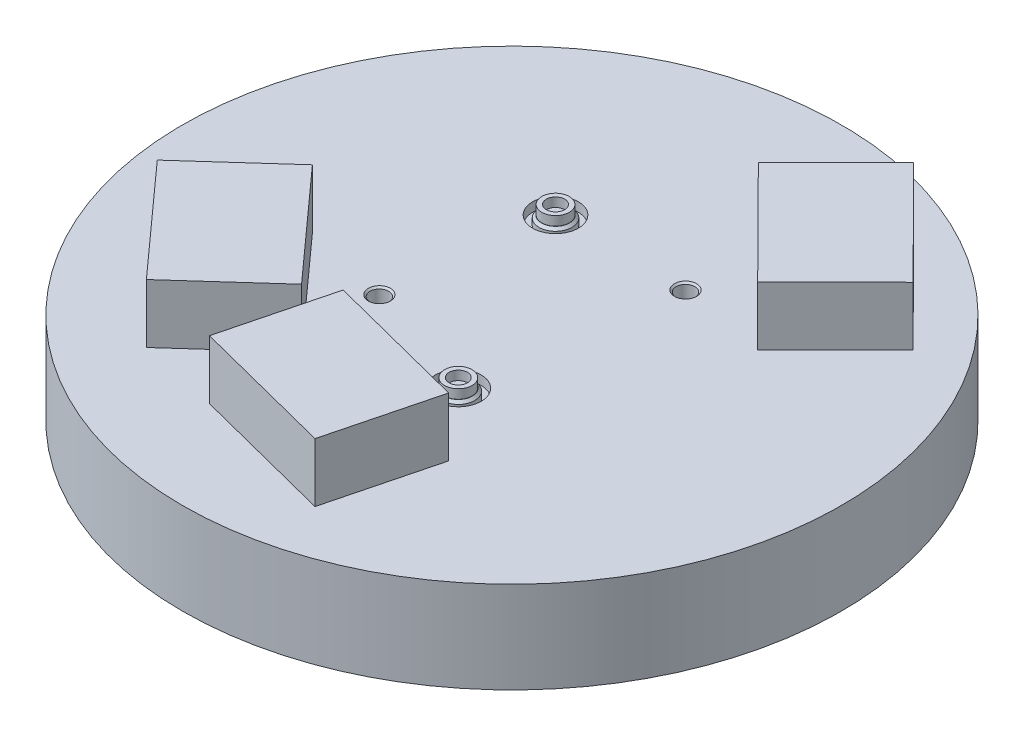
ISO-10303-21;
HEADER;
FILE_DESCRIPTION(('STEP AP214'),'2;1');
FILE_NAME('part.step','',(''),(''),'','','');
FILE_SCHEMA(('AUTOMOTIVE_DESIGN { 1 0 10303 214 1 1 1 1 }'));
ENDSEC;
DATA;
#1=APPLICATION_CONTEXT('core data for automotive mechanical design processes');
#2=APPLICATION_PROTOCOL_DEFINITION('international standard','automotive_design',2000,#1);
#3=PRODUCT_CONTEXT('',#1,'mechanical');
#4=PRODUCT('Part','Part','',(#3));
#5=PRODUCT_RELATED_PRODUCT_CATEGORY('part','',(#4));
#6=PRODUCT_DEFINITION_FORMATION('','',#4);
#7=PRODUCT_DEFINITION_CONTEXT('part definition',#1,'design');
#8=PRODUCT_DEFINITION('design','',#6,#7);
#9=PRODUCT_DEFINITION_SHAPE('','',#8);
#10=(LENGTH_UNIT() NAMED_UNIT(*) SI_UNIT(.MILLI.,.METRE.));
#11=(NAMED_UNIT(*) PLANE_ANGLE_UNIT() SI_UNIT($,.RADIAN.));
#12=(NAMED_UNIT(*) SI_UNIT($,.STERADIAN.) SOLID_ANGLE_UNIT());
#13=UNCERTAINTY_MEASURE_WITH_UNIT(LENGTH_MEASURE(1.E-05),#10,'distance_accuracy_value','');
#14=(GEOMETRIC_REPRESENTATION_CONTEXT(3) GLOBAL_UNCERTAINTY_ASSIGNED_CONTEXT((#13)) GLOBAL_UNIT_ASSIGNED_CONTEXT((#10,
#11,#12)) REPRESENTATION_CONTEXT('',''));
#15=CARTESIAN_POINT('',(0.,0.,0.));
#16=DIRECTION('',(0.,0.,1.));
#17=DIRECTION('',(1.,0.,0.));
#18=AXIS2_PLACEMENT_3D('',#15,#16,#17);
#19=CARTESIAN_POINT('',(0.,50.,0.));
#20=DIRECTION('',(0.,1.,0.));
#21=DIRECTION('',(0.,0.,1.));
#22=AXIS2_PLACEMENT_3D('',#19,#20,#21);
#23=PLANE('',#22);
#24=CARTESIAN_POINT('',(35.5000000000001,50.,-59.3));
#25=DIRECTION('',(0.,1.,0.));
#26=DIRECTION('',(0.,0.,1.));
#27=AXIS2_PLACEMENT_3D('',#24,#25,#26);
#28=CIRCLE('',#27,6.025);
#29=CARTESIAN_POINT('',(35.5000000000001,50.,-53.275));
#30=VERTEX_POINT('',#29);
#31=EDGE_CURVE('E154',#30,#30,#28,.T.);
#32=ORIENTED_EDGE('',*,*,#31,.F.);
#33=EDGE_LOOP('',(#32));
#34=FACE_BOUND('',#33,.T.);
#35=CARTESIAN_POINT('',(-45.899,50.,26.5000000000001));
#36=DIRECTION('',(0.,1.,0.));
#37=DIRECTION('',(0.,0.,1.));
#38=AXIS2_PLACEMENT_3D('',#35,#36,#37);
#39=CIRCLE('',#38,6.025);
#40=CARTESIAN_POINT('',(-45.899,50.,32.5250000000001));
#41=VERTEX_POINT('',#40);
#42=EDGE_CURVE('E147',#41,#41,#39,.T.);
#43=ORIENTED_EDGE('',*,*,#42,.F.);
#44=EDGE_LOOP('',(#43));
#45=FACE_BOUND('',#44,.T.);
#46=CARTESIAN_POINT('',(-35.4999999999999,50.,-59.3));
#47=DIRECTION('',(0.,1.,0.));
#48=DIRECTION('',(0.,0.,1.));
#49=AXIS2_PLACEMENT_3D('',#46,#47,#48);
#50=CIRCLE('',#49,12.5);
#51=CARTESIAN_POINT('',(-35.4999999999999,50.,-46.8));
#52=VERTEX_POINT('',#51);
#53=EDGE_CURVE('E168',#52,#52,#50,.T.);
#54=ORIENTED_EDGE('',*,*,#53,.F.);
#55=EDGE_LOOP('',(#54));
#56=FACE_BOUND('',#55,.T.);
#57=CARTESIAN_POINT('',(19.8540000000001,50.,49.141));
#58=DIRECTION('',(0.,1.,0.));
#59=DIRECTION('',(0.,0.,1.));
#60=AXIS2_PLACEMENT_3D('',#57,#58,#59);
#61=CIRCLE('',#60,12.5);
#62=CARTESIAN_POINT('',(19.8540000000001,50.,61.641));
#63=VERTEX_POINT('',#62);
#64=EDGE_CURVE('E163',#63,#63,#61,.T.);
#65=ORIENTED_EDGE('',*,*,#64,.F.);
#66=EDGE_LOOP('',(#65));
#67=FACE_BOUND('',#66,.T.);
#68=CARTESIAN_POINT('',(0.,50.,0.));
#69=DIRECTION('',(0.,1.,0.));
#70=DIRECTION('',(0.,0.,1.));
#71=AXIS2_PLACEMENT_3D('',#68,#69,#70);
#72=CIRCLE('',#71,180.);
#73=CARTESIAN_POINT('',(0.,50.,180.));
#74=VERTEX_POINT('',#73);
#75=EDGE_CURVE('E268',#74,#74,#72,.T.);
#76=ORIENTED_EDGE('',*,*,#75,.T.);
#77=EDGE_LOOP('',(#76));
#78=FACE_BOUND('',#77,.T.);
#79=DIRECTION('',(0.668982252871279,0.,0.74327837674943));
#80=VECTOR('',#79,1.);
#81=CARTESIAN_POINT('',(-138.066787268597,50.,55.6393031829152));
#82=LINE('',#81,#80);
#83=CARTESIAN_POINT('',(-138.066787268597,50.,55.6393031829151));
#84=VERTEX_POINT('',#83);
#85=CARTESIAN_POINT('',(-84.548207038895,50.,115.10157332287));
#86=VERTEX_POINT('',#85);
#87=EDGE_CURVE('E216',#84,#86,#82,.T.);
#88=ORIENTED_EDGE('',*,*,#87,.F.);
#89=DIRECTION('',(-0.74327837674943,0.,0.668982252871279));
#90=VECTOR('',#89,1.);
#91=CARTESIAN_POINT('',(-93.4700846636315,50.,15.5003680106384));
#92=LINE('',#91,#90);
#93=CARTESIAN_POINT('',(-93.4700846636315,50.,15.5003680106384));
#94=VERTEX_POINT('',#93);
#95=EDGE_CURVE('E255',#94,#84,#92,.T.);
#96=ORIENTED_EDGE('',*,*,#95,.F.);
#97=DIRECTION('',(-0.668982252871279,0.,-0.74327837674943));
#98=VECTOR('',#97,1.);
#99=CARTESIAN_POINT('',(-39.9515044339292,50.,74.9626381505928));
#100=LINE('',#99,#98);
#101=CARTESIAN_POINT('',(-39.9515044339292,50.,74.9626381505928));
#102=VERTEX_POINT('',#101);
#103=EDGE_CURVE('E252',#102,#94,#100,.T.);
#104=ORIENTED_EDGE('',*,*,#103,.F.);
#105=DIRECTION('',(0.74327837674943,0.,-0.668982252871279));
#106=VECTOR('',#105,1.);
#107=CARTESIAN_POINT('',(-84.548207038895,50.,115.10157332287));
#108=LINE('',#107,#106);
#109=EDGE_CURVE('E249',#86,#102,#108,.T.);
#110=ORIENTED_EDGE('',*,*,#109,.F.);
#111=EDGE_LOOP('',(#88,#96,#104,#110));
#112=FACE_BOUND('',#111,.T.);
#113=DIRECTION('',(-0.248310349340247,0.,0.968680530624274));
#114=VECTOR('',#113,1.);
#115=CARTESIAN_POINT('',(-25.8459110064985,50.,66.3316408838687));
#116=LINE('',#115,#114);
#117=CARTESIAN_POINT('',(-25.8459110064985,50.,66.3316408838686));
#118=VERTEX_POINT('',#117);
#119=CARTESIAN_POINT('',(-40.7445319669134,50.,124.452472721325));
#120=VERTEX_POINT('',#119);
#121=EDGE_CURVE('E186',#118,#120,#116,.T.);
#122=ORIENTED_EDGE('',*,*,#121,.F.);
#123=DIRECTION('',(-0.968680530624274,0.,-0.248310349340247));
#124=VECTOR('',#123,1.);
#125=CARTESIAN_POINT('',(51.6485314434434,50.,86.1964688310884));
#126=LINE('',#125,#124);
#127=CARTESIAN_POINT('',(51.6485314434434,50.,86.1964688310884));
#128=VERTEX_POINT('',#127);
#129=EDGE_CURVE('E65',#128,#118,#126,.T.);
#130=ORIENTED_EDGE('',*,*,#129,.F.);
#131=DIRECTION('',(0.248310349340247,0.,-0.968680530624274));
#132=VECTOR('',#131,1.);
#133=CARTESIAN_POINT('',(36.7499104830285,50.,144.317300668545));
#134=LINE('',#133,#132);
#135=CARTESIAN_POINT('',(36.7499104830285,50.,144.317300668545));
#136=VERTEX_POINT('',#135);
#137=EDGE_CURVE('E222',#136,#128,#134,.T.);
#138=ORIENTED_EDGE('',*,*,#137,.F.);
#139=DIRECTION('',(0.968680530624274,0.,0.248310349340247));
#140=VECTOR('',#139,1.);
#141=CARTESIAN_POINT('',(-40.7445319669134,50.,124.452472721325));
#142=LINE('',#141,#140);
#143=EDGE_CURVE('E219',#120,#136,#142,.T.);
#144=ORIENTED_EDGE('',*,*,#143,.F.);
#145=EDGE_LOOP('',(#122,#130,#138,#144));
#146=FACE_BOUND('',#145,.T.);
#147=DIRECTION('',(0.70929710886614,0.,-0.704909647652899));
#148=VECTOR('',#147,1.);
#149=CARTESIAN_POINT('',(83.556704954368,50.,-50.665585779636));
#150=LINE('',#149,#148);
#151=CARTESIAN_POINT('',(83.556704954368,50.,-50.665585779636));
#152=VERTEX_POINT('',#151);
#153=CARTESIAN_POINT('',(126.114531486336,50.,-92.9601646388099));
#154=VERTEX_POINT('',#153);
#155=EDGE_CURVE('E167',#152,#154,#150,.T.);
#156=ORIENTED_EDGE('',*,*,#155,.F.);
#157=DIRECTION('',(0.704909647652899,0.,0.70929710886614));
#158=VECTOR('',#157,1.);
#159=CARTESIAN_POINT('',(27.163933142136,50.,-107.409354488927));
#160=LINE('',#159,#158);
#161=CARTESIAN_POINT('',(27.163933142136,50.,-107.409354488927));
#162=VERTEX_POINT('',#161);
#163=EDGE_CURVE('E57',#162,#152,#160,.T.);
#164=ORIENTED_EDGE('',*,*,#163,.F.);
#165=DIRECTION('',(-0.70929710886614,0.,0.7049096476529));
#166=VECTOR('',#165,1.);
#167=CARTESIAN_POINT('',(69.7217596741044,50.,-149.703933348101));
#168=LINE('',#167,#166);
#169=CARTESIAN_POINT('',(69.7217596741044,50.,-149.703933348101));
#170=VERTEX_POINT('',#169);
#171=EDGE_CURVE('E192',#170,#162,#168,.T.);
#172=ORIENTED_EDGE('',*,*,#171,.F.);
#173=DIRECTION('',(-0.704909647652899,0.,-0.70929710886614));
#174=VECTOR('',#173,1.);
#175=CARTESIAN_POINT('',(126.114531486336,50.,-92.9601646388099));
#176=LINE('',#175,#174);
#177=EDGE_CURVE('E189',#154,#170,#176,.T.);
#178=ORIENTED_EDGE('',*,*,#177,.F.);
#179=EDGE_LOOP('',(#156,#164,#172,#178));
#180=FACE_BOUND('',#179,.T.);
#181=ADVANCED_FACE('F42',(#34,#45,#56,#67,#78,#112,#146,#180),#23,.T.);
#182=CARTESIAN_POINT('',(0.,50.,0.));
#183=DIRECTION('',(0.,-1.,0.));
#184=DIRECTION('',(0.,0.,-1.));
#185=AXIS2_PLACEMENT_3D('',#182,#183,#184);
#186=CYLINDRICAL_SURFACE('',#185,180.);
#187=ORIENTED_EDGE('',*,*,#75,.F.);
#188=EDGE_LOOP('',(#187));
#189=FACE_BOUND('',#188,.T.);
#190=CARTESIAN_POINT('',(0.,0.,0.));
#191=DIRECTION('',(0.,1.,0.));
#192=DIRECTION('',(0.,0.,1.));
#193=AXIS2_PLACEMENT_3D('',#190,#191,#192);
#194=CIRCLE('',#193,180.);
#195=CARTESIAN_POINT('',(0.,0.,180.));
#196=VERTEX_POINT('',#195);
#197=EDGE_CURVE('E246',#196,#196,#194,.T.);
#198=ORIENTED_EDGE('',*,*,#197,.T.);
#199=EDGE_LOOP('',(#198));
#200=FACE_BOUND('',#199,.T.);
#201=ADVANCED_FACE('F44',(#189,#200),#186,.T.);
#202=CARTESIAN_POINT('',(0.,0.,0.));
#203=DIRECTION('',(0.,1.,0.));
#204=DIRECTION('',(0.,0.,1.));
#205=AXIS2_PLACEMENT_3D('',#202,#203,#204);
#206=PLANE('',#205);
#207=ORIENTED_EDGE('',*,*,#197,.F.);
#208=EDGE_LOOP('',(#207));
#209=FACE_BOUND('',#208,.T.);
#210=ADVANCED_FACE('F304',(#209),#206,.F.);
#211=CARTESIAN_POINT('',(-93.4700846636316,222.147882159883,15.5003680106383));
#212=DIRECTION('',(0.668982252871279,0.,0.74327837674943));
#213=DIRECTION('',(0.74327837674943,0.,-0.668982252871279));
#214=AXIS2_PLACEMENT_3D('',#211,#212,#213);
#215=PLANE('',#214);
#216=DIRECTION('',(0.,-1.,0.));
#217=VECTOR('',#216,1.);
#218=CARTESIAN_POINT('',(-138.066787268597,222.147882159883,55.6393031829151));
#219=LINE('',#218,#217);
#220=CARTESIAN_POINT('',(-138.066787268597,82.1485421551265,55.6393031829152));
#221=VERTEX_POINT('',#220);
#222=EDGE_CURVE('E257',#221,#84,#219,.T.);
#223=ORIENTED_EDGE('',*,*,#222,.F.);
#224=DIRECTION('',(0.74327837674943,0.,-0.668982252871279));
#225=VECTOR('',#224,1.);
#226=CARTESIAN_POINT('',(-93.4700846636315,82.1485421551265,15.5003680106384));
#227=LINE('',#226,#225);
#228=CARTESIAN_POINT('',(-93.4700846636315,82.1485421551265,15.5003680106384));
#229=VERTEX_POINT('',#228);
#230=EDGE_CURVE('E240',#221,#229,#227,.T.);
#231=ORIENTED_EDGE('',*,*,#230,.T.);
#232=DIRECTION('',(0.,-1.,0.));
#233=VECTOR('',#232,1.);
#234=CARTESIAN_POINT('',(-93.4700846636316,222.147882159883,15.5003680106383));
#235=LINE('',#234,#233);
#236=EDGE_CURVE('E260',#229,#94,#235,.T.);
#237=ORIENTED_EDGE('',*,*,#236,.T.);
#238=ORIENTED_EDGE('',*,*,#95,.T.);
#239=EDGE_LOOP('',(#223,#231,#237,#238));
#240=FACE_BOUND('',#239,.T.);
#241=ADVANCED_FACE('F312',(#240),#215,.F.);
#242=CARTESIAN_POINT('',(-39.9515044339293,222.147882159883,74.9626381505927));
#243=DIRECTION('',(-0.74327837674943,0.,0.668982252871279));
#244=DIRECTION('',(0.668982252871279,0.,0.74327837674943));
#245=AXIS2_PLACEMENT_3D('',#242,#243,#244);
#246=PLANE('',#245);
#247=ORIENTED_EDGE('',*,*,#236,.F.);
#248=DIRECTION('',(0.668982252871279,0.,0.74327837674943));
#249=VECTOR('',#248,1.);
#250=CARTESIAN_POINT('',(-39.9515044339292,82.1485421551265,74.9626381505928));
#251=LINE('',#250,#249);
#252=CARTESIAN_POINT('',(-39.9515044339292,82.1485421551265,74.9626381505928));
#253=VERTEX_POINT('',#252);
#254=EDGE_CURVE('E236',#229,#253,#251,.T.);
#255=ORIENTED_EDGE('',*,*,#254,.T.);
#256=DIRECTION('',(0.,-1.,0.));
#257=VECTOR('',#256,1.);
#258=CARTESIAN_POINT('',(-39.9515044339293,222.147882159883,74.9626381505927));
#259=LINE('',#258,#257);
#260=EDGE_CURVE('E262',#253,#102,#259,.T.);
#261=ORIENTED_EDGE('',*,*,#260,.T.);
#262=ORIENTED_EDGE('',*,*,#103,.T.);
#263=EDGE_LOOP('',(#247,#255,#261,#262));
#264=FACE_BOUND('',#263,.T.);
#265=ADVANCED_FACE('F317',(#264),#246,.F.);
#266=CARTESIAN_POINT('',(-84.5482070388951,222.147882159883,115.10157332287));
#267=DIRECTION('',(-0.668982252871279,0.,-0.74327837674943));
#268=DIRECTION('',(-0.74327837674943,0.,0.668982252871279));
#269=AXIS2_PLACEMENT_3D('',#266,#267,#268);
#270=PLANE('',#269);
#271=ORIENTED_EDGE('',*,*,#260,.F.);
#272=DIRECTION('',(-0.74327837674943,0.,0.668982252871279));
#273=VECTOR('',#272,1.);
#274=CARTESIAN_POINT('',(-84.548207038895,82.1485421551265,115.10157332287));
#275=LINE('',#274,#273);
#276=CARTESIAN_POINT('',(-84.5482070388951,82.1485421551265,115.10157332287));
#277=VERTEX_POINT('',#276);
#278=EDGE_CURVE('E239',#253,#277,#275,.T.);
#279=ORIENTED_EDGE('',*,*,#278,.T.);
#280=DIRECTION('',(0.,-1.,0.));
#281=VECTOR('',#280,1.);
#282=CARTESIAN_POINT('',(-84.5482070388951,222.147882159883,115.10157332287));
#283=LINE('',#282,#281);
#284=EDGE_CURVE('E264',#277,#86,#283,.T.);
#285=ORIENTED_EDGE('',*,*,#284,.T.);
#286=ORIENTED_EDGE('',*,*,#109,.T.);
#287=EDGE_LOOP('',(#271,#279,#285,#286));
#288=FACE_BOUND('',#287,.T.);
#289=ADVANCED_FACE('F325',(#288),#270,.F.);
#290=CARTESIAN_POINT('',(-138.066787268597,222.147882159883,55.6393031829151));
#291=DIRECTION('',(0.74327837674943,0.,-0.668982252871279));
#292=DIRECTION('',(-0.668982252871279,0.,-0.74327837674943));
#293=AXIS2_PLACEMENT_3D('',#290,#291,#292);
#294=PLANE('',#293);
#295=ORIENTED_EDGE('',*,*,#284,.F.);
#296=DIRECTION('',(-0.668982252871279,0.,-0.74327837674943));
#297=VECTOR('',#296,1.);
#298=CARTESIAN_POINT('',(-138.066787268597,82.1485421551265,55.6393031829151));
#299=LINE('',#298,#297);
#300=EDGE_CURVE('E243',#277,#221,#299,.T.);
#301=ORIENTED_EDGE('',*,*,#300,.T.);
#302=ORIENTED_EDGE('',*,*,#222,.T.);
#303=ORIENTED_EDGE('',*,*,#87,.T.);
#304=EDGE_LOOP('',(#295,#301,#302,#303));
#305=FACE_BOUND('',#304,.T.);
#306=ADVANCED_FACE('F309',(#305),#294,.F.);
#307=CARTESIAN_POINT('',(69.7217610432258,82.1485421551264,-149.70393282983));
#308=DIRECTION('',(0.,-1.,0.));
#309=DIRECTION('',(0.709297119541637,0.,-0.704909636910957));
#310=AXIS2_PLACEMENT_3D('',#307,#308,#309);
#311=PLANE('',#310);
#312=ORIENTED_EDGE('',*,*,#278,.F.);
#313=ORIENTED_EDGE('',*,*,#254,.F.);
#314=ORIENTED_EDGE('',*,*,#230,.F.);
#315=ORIENTED_EDGE('',*,*,#300,.F.);
#316=EDGE_LOOP('',(#312,#313,#314,#315));
#317=FACE_BOUND('',#316,.T.);
#318=ADVANCED_FACE('F330',(#317),#311,.F.);
#319=CARTESIAN_POINT('',(51.6485314434433,222.147882159883,86.1964688310883));
#320=DIRECTION('',(-0.248310349340247,0.,0.968680530624274));
#321=DIRECTION('',(0.968680530624274,0.,0.248310349340247));
#322=AXIS2_PLACEMENT_3D('',#319,#320,#321);
#323=PLANE('',#322);
#324=DIRECTION('',(0.,-1.,0.));
#325=VECTOR('',#324,1.);
#326=CARTESIAN_POINT('',(-25.8459110064986,222.147882159883,66.3316408838686));
#327=LINE('',#326,#325);
#328=CARTESIAN_POINT('',(-25.8459110064986,82.1485421551265,66.3316408838686));
#329=VERTEX_POINT('',#328);
#330=EDGE_CURVE('E226',#329,#118,#327,.T.);
#331=ORIENTED_EDGE('',*,*,#330,.F.);
#332=DIRECTION('',(0.968680530624274,0.,0.248310349340247));
#333=VECTOR('',#332,1.);
#334=CARTESIAN_POINT('',(51.6485314434433,82.1485421551266,86.1964688310884));
#335=LINE('',#334,#333);
#336=CARTESIAN_POINT('',(51.6485314434433,82.1485421551265,86.1964688310884));
#337=VERTEX_POINT('',#336);
#338=EDGE_CURVE('E210',#329,#337,#335,.T.);
#339=ORIENTED_EDGE('',*,*,#338,.T.);
#340=DIRECTION('',(0.,-1.,0.));
#341=VECTOR('',#340,1.);
#342=CARTESIAN_POINT('',(51.6485314434433,222.147882159883,86.1964688310883));
#343=LINE('',#342,#341);
#344=EDGE_CURVE('E228',#337,#128,#343,.T.);
#345=ORIENTED_EDGE('',*,*,#344,.T.);
#346=ORIENTED_EDGE('',*,*,#129,.T.);
#347=EDGE_LOOP('',(#331,#339,#345,#346));
#348=FACE_BOUND('',#347,.T.);
#349=ADVANCED_FACE('F381',(#348),#323,.F.);
#350=CARTESIAN_POINT('',(36.7499104830285,222.147882159883,144.317300668545));
#351=DIRECTION('',(-0.968680530624274,0.,-0.248310349340247));
#352=DIRECTION('',(-0.248310349340247,0.,0.968680530624274));
#353=AXIS2_PLACEMENT_3D('',#350,#351,#352);
#354=PLANE('',#353);
#355=ORIENTED_EDGE('',*,*,#344,.F.);
#356=DIRECTION('',(-0.248310349340247,0.,0.968680530624274));
#357=VECTOR('',#356,1.);
#358=CARTESIAN_POINT('',(36.7499104830285,82.1485421551266,144.317300668545));
#359=LINE('',#358,#357);
#360=CARTESIAN_POINT('',(36.7499104830285,82.1485421551266,144.317300668545));
#361=VERTEX_POINT('',#360);
#362=EDGE_CURVE('E206',#337,#361,#359,.T.);
#363=ORIENTED_EDGE('',*,*,#362,.T.);
#364=DIRECTION('',(0.,-1.,0.));
#365=VECTOR('',#364,1.);
#366=CARTESIAN_POINT('',(36.7499104830285,222.147882159883,144.317300668545));
#367=LINE('',#366,#365);
#368=EDGE_CURVE('E230',#361,#136,#367,.T.);
#369=ORIENTED_EDGE('',*,*,#368,.T.);
#370=ORIENTED_EDGE('',*,*,#137,.T.);
#371=EDGE_LOOP('',(#355,#363,#369,#370));
#372=FACE_BOUND('',#371,.T.);
#373=ADVANCED_FACE('F384',(#372),#354,.F.);
#374=CARTESIAN_POINT('',(-40.7445319669134,222.147882159883,124.452472721325));
#375=DIRECTION('',(0.248310349340247,0.,-0.968680530624274));
#376=DIRECTION('',(-0.968680530624274,0.,-0.248310349340247));
#377=AXIS2_PLACEMENT_3D('',#374,#375,#376);
#378=PLANE('',#377);
#379=ORIENTED_EDGE('',*,*,#368,.F.);
#380=DIRECTION('',(-0.968680530624274,0.,-0.248310349340247));
#381=VECTOR('',#380,1.);
#382=CARTESIAN_POINT('',(-40.7445319669134,82.1485421551266,124.452472721325));
#383=LINE('',#382,#381);
#384=CARTESIAN_POINT('',(-40.7445319669134,82.1485421551266,124.452472721325));
#385=VERTEX_POINT('',#384);
#386=EDGE_CURVE('E209',#361,#385,#383,.T.);
#387=ORIENTED_EDGE('',*,*,#386,.T.);
#388=DIRECTION('',(0.,-1.,0.));
#389=VECTOR('',#388,1.);
#390=CARTESIAN_POINT('',(-40.7445319669134,222.147882159883,124.452472721325));
#391=LINE('',#390,#389);
#392=EDGE_CURVE('E232',#385,#120,#391,.T.);
#393=ORIENTED_EDGE('',*,*,#392,.T.);
#394=ORIENTED_EDGE('',*,*,#143,.T.);
#395=EDGE_LOOP('',(#379,#387,#393,#394));
#396=FACE_BOUND('',#395,.T.);
#397=ADVANCED_FACE('F387',(#396),#378,.F.);
#398=CARTESIAN_POINT('',(-25.8459110064986,222.147882159883,66.3316408838686));
#399=DIRECTION('',(0.968680530624274,0.,0.248310349340247));
#400=DIRECTION('',(0.248310349340247,0.,-0.968680530624274));
#401=AXIS2_PLACEMENT_3D('',#398,#399,#400);
#402=PLANE('',#401);
#403=ORIENTED_EDGE('',*,*,#392,.F.);
#404=DIRECTION('',(0.248310349340247,0.,-0.968680530624274));
#405=VECTOR('',#404,1.);
#406=CARTESIAN_POINT('',(-25.8459110064986,82.1485421551265,66.3316408838686));
#407=LINE('',#406,#405);
#408=EDGE_CURVE('E213',#385,#329,#407,.T.);
#409=ORIENTED_EDGE('',*,*,#408,.T.);
#410=ORIENTED_EDGE('',*,*,#330,.T.);
#411=ORIENTED_EDGE('',*,*,#121,.T.);
#412=EDGE_LOOP('',(#403,#409,#410,#411));
#413=FACE_BOUND('',#412,.T.);
#414=ADVANCED_FACE('F379',(#413),#402,.F.);
#415=CARTESIAN_POINT('',(69.7217610432258,82.1485421551264,-149.70393282983));
#416=DIRECTION('',(0.,-1.,0.));
#417=DIRECTION('',(0.709297119541637,0.,-0.704909636910957));
#418=AXIS2_PLACEMENT_3D('',#415,#416,#417);
#419=PLANE('',#418);
#420=ORIENTED_EDGE('',*,*,#386,.F.);
#421=ORIENTED_EDGE('',*,*,#362,.F.);
#422=ORIENTED_EDGE('',*,*,#338,.F.);
#423=ORIENTED_EDGE('',*,*,#408,.F.);
#424=EDGE_LOOP('',(#420,#421,#422,#423));
#425=FACE_BOUND('',#424,.T.);
#426=ADVANCED_FACE('F376',(#425),#419,.F.);
#427=CARTESIAN_POINT('',(27.163933142136,222.147882159883,-107.409354488927));
#428=DIRECTION('',(0.70929710886614,0.,-0.704909647652899));
#429=DIRECTION('',(-0.704909647652899,0.,-0.70929710886614));
#430=AXIS2_PLACEMENT_3D('',#427,#428,#429);
#431=PLANE('',#430);
#432=DIRECTION('',(0.,-1.,0.));
#433=VECTOR('',#432,1.);
#434=CARTESIAN_POINT('',(83.5567049543679,222.147882159883,-50.6655857796361));
#435=LINE('',#434,#433);
#436=CARTESIAN_POINT('',(83.556704954368,82.1485421551265,-50.665585779636));
#437=VERTEX_POINT('',#436);
#438=EDGE_CURVE('E196',#437,#152,#435,.T.);
#439=ORIENTED_EDGE('',*,*,#438,.F.);
#440=DIRECTION('',(-0.704909647652899,0.,-0.70929710886614));
#441=VECTOR('',#440,1.);
#442=CARTESIAN_POINT('',(27.163933142136,82.1485421551264,-107.409354488927));
#443=LINE('',#442,#441);
#444=CARTESIAN_POINT('',(27.163933142136,82.1485421551265,-107.409354488927));
#445=VERTEX_POINT('',#444);
#446=EDGE_CURVE('E180',#437,#445,#443,.T.);
#447=ORIENTED_EDGE('',*,*,#446,.T.);
#448=DIRECTION('',(0.,-1.,0.));
#449=VECTOR('',#448,1.);
#450=CARTESIAN_POINT('',(27.163933142136,222.147882159883,-107.409354488927));
#451=LINE('',#450,#449);
#452=EDGE_CURVE('E198',#445,#162,#451,.T.);
#453=ORIENTED_EDGE('',*,*,#452,.T.);
#454=ORIENTED_EDGE('',*,*,#163,.T.);
#455=EDGE_LOOP('',(#439,#447,#453,#454));
#456=FACE_BOUND('',#455,.T.);
#457=ADVANCED_FACE('F357',(#456),#431,.F.);
#458=CARTESIAN_POINT('',(69.7217596741044,222.147882159883,-149.703933348101));
#459=DIRECTION('',(0.7049096476529,0.,0.70929710886614));
#460=DIRECTION('',(0.70929710886614,0.,-0.7049096476529));
#461=AXIS2_PLACEMENT_3D('',#458,#459,#460);
#462=PLANE('',#461);
#463=ORIENTED_EDGE('',*,*,#452,.F.);
#464=DIRECTION('',(0.70929710886614,0.,-0.7049096476529));
#465=VECTOR('',#464,1.);
#466=CARTESIAN_POINT('',(69.7217596741044,82.1485421551264,-149.703933348101));
#467=LINE('',#466,#465);
#468=CARTESIAN_POINT('',(69.7217596741044,82.1485421551264,-149.703933348101));
#469=VERTEX_POINT('',#468);
#470=EDGE_CURVE('E176',#445,#469,#467,.T.);
#471=ORIENTED_EDGE('',*,*,#470,.T.);
#472=DIRECTION('',(0.,-1.,0.));
#473=VECTOR('',#472,1.);
#474=CARTESIAN_POINT('',(69.7217596741044,222.147882159883,-149.703933348101));
#475=LINE('',#474,#473);
#476=EDGE_CURVE('E200',#469,#170,#475,.T.);
#477=ORIENTED_EDGE('',*,*,#476,.T.);
#478=ORIENTED_EDGE('',*,*,#171,.T.);
#479=EDGE_LOOP('',(#463,#471,#477,#478));
#480=FACE_BOUND('',#479,.T.);
#481=ADVANCED_FACE('F363',(#480),#462,.F.);
#482=CARTESIAN_POINT('',(126.114531486336,222.147882159883,-92.96016463881));
#483=DIRECTION('',(-0.70929710886614,0.,0.704909647652899));
#484=DIRECTION('',(0.704909647652899,0.,0.70929710886614));
#485=AXIS2_PLACEMENT_3D('',#482,#483,#484);
#486=PLANE('',#485);
#487=ORIENTED_EDGE('',*,*,#476,.F.);
#488=DIRECTION('',(0.704909647652899,0.,0.70929710886614));
#489=VECTOR('',#488,1.);
#490=CARTESIAN_POINT('',(126.114531486336,82.1485421551265,-92.96016463881));
#491=LINE('',#490,#489);
#492=CARTESIAN_POINT('',(126.114531486336,82.1485421551265,-92.9601646388099));
#493=VERTEX_POINT('',#492);
#494=EDGE_CURVE('E179',#469,#493,#491,.T.);
#495=ORIENTED_EDGE('',*,*,#494,.T.);
#496=DIRECTION('',(0.,-1.,0.));
#497=VECTOR('',#496,1.);
#498=CARTESIAN_POINT('',(126.114531486336,222.147882159883,-92.96016463881));
#499=LINE('',#498,#497);
#500=EDGE_CURVE('E202',#493,#154,#499,.T.);
#501=ORIENTED_EDGE('',*,*,#500,.T.);
#502=ORIENTED_EDGE('',*,*,#177,.T.);
#503=EDGE_LOOP('',(#487,#495,#501,#502));
#504=FACE_BOUND('',#503,.T.);
#505=ADVANCED_FACE('F365',(#504),#486,.F.);
#506=CARTESIAN_POINT('',(83.5567049543679,222.147882159883,-50.6655857796361));
#507=DIRECTION('',(-0.704909647652899,0.,-0.70929710886614));
#508=DIRECTION('',(-0.70929710886614,0.,0.704909647652899));
#509=AXIS2_PLACEMENT_3D('',#506,#507,#508);
#510=PLANE('',#509);
#511=ORIENTED_EDGE('',*,*,#500,.F.);
#512=DIRECTION('',(-0.70929710886614,0.,0.704909647652899));
#513=VECTOR('',#512,1.);
#514=CARTESIAN_POINT('',(83.556704954368,82.1485421551265,-50.665585779636));
#515=LINE('',#514,#513);
#516=EDGE_CURVE('E183',#493,#437,#515,.T.);
#517=ORIENTED_EDGE('',*,*,#516,.T.);
#518=ORIENTED_EDGE('',*,*,#438,.T.);
#519=ORIENTED_EDGE('',*,*,#155,.T.);
#520=EDGE_LOOP('',(#511,#517,#518,#519));
#521=FACE_BOUND('',#520,.T.);
#522=ADVANCED_FACE('F356',(#521),#510,.F.);
#523=CARTESIAN_POINT('',(69.7217610432258,82.1485421551264,-149.70393282983));
#524=DIRECTION('',(0.,-1.,0.));
#525=DIRECTION('',(0.709297119541637,0.,-0.704909636910957));
#526=AXIS2_PLACEMENT_3D('',#523,#524,#525);
#527=PLANE('',#526);
#528=ORIENTED_EDGE('',*,*,#494,.F.);
#529=ORIENTED_EDGE('',*,*,#470,.F.);
#530=ORIENTED_EDGE('',*,*,#446,.F.);
#531=ORIENTED_EDGE('',*,*,#516,.F.);
#532=EDGE_LOOP('',(#528,#529,#530,#531));
#533=FACE_BOUND('',#532,.T.);
#534=ADVANCED_FACE('F360',(#533),#527,.F.);
#535=CARTESIAN_POINT('',(19.8540000000001,45.,49.141));
#536=DIRECTION('',(0.,1.,0.));
#537=DIRECTION('',(0.,0.,1.));
#538=AXIS2_PLACEMENT_3D('',#535,#536,#537);
#539=CYLINDRICAL_SURFACE('',#538,12.5);
#540=CARTESIAN_POINT('',(19.8540000000001,45.,49.141));
#541=DIRECTION('',(0.,1.,0.));
#542=DIRECTION('',(0.,0.,1.));
#543=AXIS2_PLACEMENT_3D('',#540,#541,#542);
#544=CIRCLE('',#543,12.5);
#545=CARTESIAN_POINT('',(19.8540000000001,45.,61.641));
#546=VERTEX_POINT('',#545);
#547=EDGE_CURVE('E171',#546,#546,#544,.T.);
#548=ORIENTED_EDGE('',*,*,#547,.F.);
#549=EDGE_LOOP('',(#548));
#550=FACE_BOUND('',#549,.T.);
#551=ORIENTED_EDGE('',*,*,#64,.T.);
#552=EDGE_LOOP('',(#551));
#553=FACE_BOUND('',#552,.T.);
#554=ADVANCED_FACE('F433',(#550,#553),#539,.F.);
#555=CARTESIAN_POINT('',(19.8540000000001,45.,49.141));
#556=DIRECTION('',(0.,1.,0.));
#557=DIRECTION('',(0.,0.,1.));
#558=AXIS2_PLACEMENT_3D('',#555,#556,#557);
#559=PLANE('',#558);
#560=ORIENTED_EDGE('',*,*,#547,.T.);
#561=EDGE_LOOP('',(#560));
#562=FACE_BOUND('',#561,.T.);
#563=CARTESIAN_POINT('',(19.8540000000001,45.,49.141));
#564=DIRECTION('',(0.,-1.,0.));
#565=DIRECTION('',(0.,0.,-1.));
#566=AXIS2_PLACEMENT_3D('',#563,#564,#565);
#567=CIRCLE('',#566,9.);
#568=CARTESIAN_POINT('',(19.8540000000001,45.,40.141));
#569=VERTEX_POINT('',#568);
#570=EDGE_CURVE('E676',#569,#569,#567,.T.);
#571=ORIENTED_EDGE('',*,*,#570,.T.);
#572=EDGE_LOOP('',(#571));
#573=FACE_BOUND('',#572,.T.);
#574=ADVANCED_FACE('F442',(#562,#573),#559,.T.);
#575=CARTESIAN_POINT('',(-35.4999999999999,45.,-59.3));
#576=DIRECTION('',(0.,1.,0.));
#577=DIRECTION('',(0.,0.,1.));
#578=AXIS2_PLACEMENT_3D('',#575,#576,#577);
#579=CYLINDRICAL_SURFACE('',#578,12.5);
#580=CARTESIAN_POINT('',(-35.4999999999999,45.,-59.3));
#581=DIRECTION('',(0.,1.,0.));
#582=DIRECTION('',(0.,0.,1.));
#583=AXIS2_PLACEMENT_3D('',#580,#581,#582);
#584=CIRCLE('',#583,12.5);
#585=CARTESIAN_POINT('',(-35.4999999999999,45.,-46.8));
#586=VERTEX_POINT('',#585);
#587=EDGE_CURVE('E164',#586,#586,#584,.T.);
#588=ORIENTED_EDGE('',*,*,#587,.F.);
#589=EDGE_LOOP('',(#588));
#590=FACE_BOUND('',#589,.T.);
#591=ORIENTED_EDGE('',*,*,#53,.T.);
#592=EDGE_LOOP('',(#591));
#593=FACE_BOUND('',#592,.T.);
#594=ADVANCED_FACE('F450',(#590,#593),#579,.F.);
#595=CARTESIAN_POINT('',(-35.4999999999999,45.,-59.3));
#596=DIRECTION('',(0.,1.,0.));
#597=DIRECTION('',(0.,0.,1.));
#598=AXIS2_PLACEMENT_3D('',#595,#596,#597);
#599=PLANE('',#598);
#600=ORIENTED_EDGE('',*,*,#587,.T.);
#601=EDGE_LOOP('',(#600));
#602=FACE_BOUND('',#601,.T.);
#603=CARTESIAN_POINT('',(-35.4999999999999,45.,-59.3));
#604=DIRECTION('',(0.,-1.,0.));
#605=DIRECTION('',(0.,0.,-1.));
#606=AXIS2_PLACEMENT_3D('',#603,#604,#605);
#607=CIRCLE('',#606,9.);
#608=CARTESIAN_POINT('',(-35.4999999999999,45.,-68.3));
#609=VERTEX_POINT('',#608);
#610=EDGE_CURVE('E690',#609,#609,#607,.T.);
#611=ORIENTED_EDGE('',*,*,#610,.T.);
#612=EDGE_LOOP('',(#611));
#613=FACE_BOUND('',#612,.T.);
#614=ADVANCED_FACE('F455',(#602,#613),#599,.T.);
#615=CARTESIAN_POINT('',(-45.899,32.5,26.5000000000001));
#616=DIRECTION('',(0.,1.,0.));
#617=DIRECTION('',(0.,0.,1.));
#618=AXIS2_PLACEMENT_3D('',#615,#616,#617);
#619=CONICAL_SURFACE('',#618,5.09999999999999,1.02974425867665);
#620=CARTESIAN_POINT('',(-45.899,29.4356108429594,26.5000000000001));
#621=VERTEX_POINT('',#620);
#622=VERTEX_LOOP('',#621);
#623=FACE_BOUND('',#622,.T.);
#624=CARTESIAN_POINT('',(-45.899,32.5,26.5000000000001));
#625=DIRECTION('',(0.,1.,0.));
#626=DIRECTION('',(0.,0.,1.));
#627=AXIS2_PLACEMENT_3D('',#624,#625,#626);
#628=CIRCLE('',#627,5.09999999999999);
#629=CARTESIAN_POINT('',(-45.899,32.5,31.6000000000001));
#630=VERTEX_POINT('',#629);
#631=EDGE_CURVE('E160',#630,#630,#628,.T.);
#632=ORIENTED_EDGE('',*,*,#631,.T.);
#633=EDGE_LOOP('',(#632));
#634=FACE_BOUND('',#633,.T.);
#635=ADVANCED_FACE('F474',(#623,#634),#619,.F.);
#636=CARTESIAN_POINT('',(-45.899,50.,26.5000000000001));
#637=DIRECTION('',(0.,1.,0.));
#638=DIRECTION('',(0.,0.,1.));
#639=AXIS2_PLACEMENT_3D('',#636,#637,#638);
#640=CYLINDRICAL_SURFACE('',#639,5.1);
#641=ORIENTED_EDGE('',*,*,#631,.F.);
#642=EDGE_LOOP('',(#641));
#643=FACE_BOUND('',#642,.T.);
#644=CARTESIAN_POINT('',(-45.899,49.075,26.5000000000001));
#645=DIRECTION('',(0.,1.,0.));
#646=DIRECTION('',(0.,0.,1.));
#647=AXIS2_PLACEMENT_3D('',#644,#645,#646);
#648=CIRCLE('',#647,5.1);
#649=CARTESIAN_POINT('',(-45.899,49.075,31.6000000000001));
#650=VERTEX_POINT('',#649);
#651=EDGE_CURVE('E151',#650,#650,#648,.T.);
#652=ORIENTED_EDGE('',*,*,#651,.T.);
#653=EDGE_LOOP('',(#652));
#654=FACE_BOUND('',#653,.T.);
#655=ADVANCED_FACE('F479',(#643,#654),#640,.F.);
#656=CARTESIAN_POINT('',(-45.899,50.,26.5000000000001));
#657=DIRECTION('',(0.,1.,0.));
#658=DIRECTION('',(0.,0.,1.));
#659=AXIS2_PLACEMENT_3D('',#656,#657,#658);
#660=CONICAL_SURFACE('',#659,6.025,0.785398163397452);
#661=ORIENTED_EDGE('',*,*,#651,.F.);
#662=EDGE_LOOP('',(#661));
#663=FACE_BOUND('',#662,.T.);
#664=ORIENTED_EDGE('',*,*,#42,.T.);
#665=EDGE_LOOP('',(#664));
#666=FACE_BOUND('',#665,.T.);
#667=ADVANCED_FACE('F141',(#663,#666),#660,.F.);
#668=CARTESIAN_POINT('',(35.5000000000001,32.5,-59.3));
#669=DIRECTION('',(0.,1.,0.));
#670=DIRECTION('',(0.,0.,1.));
#671=AXIS2_PLACEMENT_3D('',#668,#669,#670);
#672=CONICAL_SURFACE('',#671,5.09999999999999,1.02974425867665);
#673=CARTESIAN_POINT('',(35.5000000000001,29.4356108429594,-59.3));
#674=VERTEX_POINT('',#673);
#675=VERTEX_LOOP('',#674);
#676=FACE_BOUND('',#675,.T.);
#677=CARTESIAN_POINT('',(35.5000000000001,32.5,-59.3));
#678=DIRECTION('',(0.,1.,0.));
#679=DIRECTION('',(0.,0.,1.));
#680=AXIS2_PLACEMENT_3D('',#677,#678,#679);
#681=CIRCLE('',#680,5.09999999999999);
#682=CARTESIAN_POINT('',(35.5000000000001,32.5,-54.2));
#683=VERTEX_POINT('',#682);
#684=EDGE_CURVE('E145',#683,#683,#681,.T.);
#685=ORIENTED_EDGE('',*,*,#684,.T.);
#686=EDGE_LOOP('',(#685));
#687=FACE_BOUND('',#686,.T.);
#688=ADVANCED_FACE('F137',(#676,#687),#672,.F.);
#689=CARTESIAN_POINT('',(35.5000000000001,50.,-59.3));
#690=DIRECTION('',(0.,1.,0.));
#691=DIRECTION('',(0.,0.,1.));
#692=AXIS2_PLACEMENT_3D('',#689,#690,#691);
#693=CYLINDRICAL_SURFACE('',#692,5.1);
#694=ORIENTED_EDGE('',*,*,#684,.F.);
#695=EDGE_LOOP('',(#694));
#696=FACE_BOUND('',#695,.T.);
#697=CARTESIAN_POINT('',(35.5000000000001,49.075,-59.3));
#698=DIRECTION('',(0.,1.,0.));
#699=DIRECTION('',(0.,0.,1.));
#700=AXIS2_PLACEMENT_3D('',#697,#698,#699);
#701=CIRCLE('',#700,5.1);
#702=CARTESIAN_POINT('',(35.5000000000001,49.075,-54.2));
#703=VERTEX_POINT('',#702);
#704=EDGE_CURVE('E148',#703,#703,#701,.T.);
#705=ORIENTED_EDGE('',*,*,#704,.T.);
#706=EDGE_LOOP('',(#705));
#707=FACE_BOUND('',#706,.T.);
#708=ADVANCED_FACE('F140',(#696,#707),#693,.F.);
#709=CARTESIAN_POINT('',(35.5000000000001,50.,-59.3));
#710=DIRECTION('',(0.,1.,0.));
#711=DIRECTION('',(0.,0.,1.));
#712=AXIS2_PLACEMENT_3D('',#709,#710,#711);
#713=CONICAL_SURFACE('',#712,6.025,0.785398163397452);
#714=ORIENTED_EDGE('',*,*,#704,.F.);
#715=EDGE_LOOP('',(#714));
#716=FACE_BOUND('',#715,.T.);
#717=ORIENTED_EDGE('',*,*,#31,.T.);
#718=EDGE_LOOP('',(#717));
#719=FACE_BOUND('',#718,.T.);
#720=ADVANCED_FACE('F516',(#716,#719),#713,.F.);
#721=CARTESIAN_POINT('',(-35.4999999999999,50.,-59.3));
#722=DIRECTION('',(0.,-1.,0.));
#723=DIRECTION('',(0.,0.,-1.));
#724=AXIS2_PLACEMENT_3D('',#721,#722,#723);
#725=CYLINDRICAL_SURFACE('',#724,9.);
#726=ORIENTED_EDGE('',*,*,#610,.F.);
#727=EDGE_LOOP('',(#726));
#728=FACE_BOUND('',#727,.T.);
#729=CARTESIAN_POINT('',(-35.4999999999999,48.626,-59.3));
#730=DIRECTION('',(0.,-1.,0.));
#731=DIRECTION('',(0.,0.,-1.));
#732=AXIS2_PLACEMENT_3D('',#729,#730,#731);
#733=CIRCLE('',#732,9.);
#734=CARTESIAN_POINT('',(-35.4999999999999,48.626,-68.3));
#735=VERTEX_POINT('',#734);
#736=EDGE_CURVE('E680',#735,#735,#733,.T.);
#737=ORIENTED_EDGE('',*,*,#736,.T.);
#738=EDGE_LOOP('',(#737));
#739=FACE_BOUND('',#738,.T.);
#740=ADVANCED_FACE('F289',(#728,#739),#725,.T.);
#741=CARTESIAN_POINT('',(-35.4999999999999,50.,-59.3));
#742=DIRECTION('',(0.,-1.,0.));
#743=DIRECTION('',(0.,0.,-1.));
#744=AXIS2_PLACEMENT_3D('',#741,#742,#743);
#745=CONICAL_SURFACE('',#744,7.626,0.785398163397448);
#746=ORIENTED_EDGE('',*,*,#736,.F.);
#747=EDGE_LOOP('',(#746));
#748=FACE_BOUND('',#747,.T.);
#749=CARTESIAN_POINT('',(-35.4999999999999,50.,-59.3));
#750=DIRECTION('',(0.,-1.,0.));
#751=DIRECTION('',(0.,0.,-1.));
#752=AXIS2_PLACEMENT_3D('',#749,#750,#751);
#753=CIRCLE('',#752,7.626);
#754=CARTESIAN_POINT('',(-35.4999999999999,50.,-66.926));
#755=VERTEX_POINT('',#754);
#756=EDGE_CURVE('E687',#755,#755,#753,.T.);
#757=ORIENTED_EDGE('',*,*,#756,.T.);
#758=EDGE_LOOP('',(#757));
#759=FACE_BOUND('',#758,.T.);
#760=ADVANCED_FACE('F279',(#748,#759),#745,.T.);
#761=CARTESIAN_POINT('',(-35.4999999999999,50.,-59.3));
#762=DIRECTION('',(0.,1.,0.));
#763=DIRECTION('',(0.,0.,1.));
#764=AXIS2_PLACEMENT_3D('',#761,#762,#763);
#765=PLANE('',#764);
#766=CARTESIAN_POINT('',(-35.4999999999999,50.,-59.3));
#767=DIRECTION('',(0.,1.,0.));
#768=DIRECTION('',(0.,0.,1.));
#769=AXIS2_PLACEMENT_3D('',#766,#767,#768);
#770=CIRCLE('',#769,5.);
#771=CARTESIAN_POINT('',(-35.4999999999999,50.,-54.3));
#772=VERTEX_POINT('',#771);
#773=EDGE_CURVE('E50',#772,#772,#770,.F.);
#774=ORIENTED_EDGE('',*,*,#773,.F.);
#775=EDGE_LOOP('',(#774));
#776=FACE_BOUND('',#775,.T.);
#777=ADVANCED_FACE('F277',(#776),#765,.T.);
#778=CARTESIAN_POINT('',(-35.4999999999999,55.,-59.3));
#779=DIRECTION('',(0.,-1.,0.));
#780=DIRECTION('',(0.,0.,-1.));
#781=AXIS2_PLACEMENT_3D('',#778,#779,#780);
#782=CYLINDRICAL_SURFACE('',#781,5.);
#783=CARTESIAN_POINT('',(-35.4999999999999,55.,-59.3));
#784=DIRECTION('',(0.,1.,0.));
#785=DIRECTION('',(0.,0.,1.));
#786=AXIS2_PLACEMENT_3D('',#783,#784,#785);
#787=CIRCLE('',#786,5.);
#788=CARTESIAN_POINT('',(-35.4999999999999,55.,-54.3));
#789=VERTEX_POINT('',#788);
#790=EDGE_CURVE('E699',#789,#789,#787,.T.);
#791=ORIENTED_EDGE('',*,*,#790,.T.);
#792=EDGE_LOOP('',(#791));
#793=FACE_BOUND('',#792,.T.);
#794=ORIENTED_EDGE('',*,*,#773,.T.);
#795=EDGE_LOOP('',(#794));
#796=FACE_BOUND('',#795,.T.);
#797=ADVANCED_FACE('F275',(#793,#796),#782,.F.);
#798=CARTESIAN_POINT('',(-35.4999999999999,55.,-59.3));
#799=DIRECTION('',(0.,1.,0.));
#800=DIRECTION('',(0.,0.,1.));
#801=AXIS2_PLACEMENT_3D('',#798,#799,#800);
#802=PLANE('',#801);
#803=CARTESIAN_POINT('',(-35.4999999999999,55.,-59.3));
#804=DIRECTION('',(0.,1.,0.));
#805=DIRECTION('',(0.,0.,1.));
#806=AXIS2_PLACEMENT_3D('',#803,#804,#805);
#807=CIRCLE('',#806,7.5);
#808=CARTESIAN_POINT('',(-35.4999999999999,55.,-51.8));
#809=VERTEX_POINT('',#808);
#810=EDGE_CURVE('E704',#809,#809,#807,.T.);
#811=ORIENTED_EDGE('',*,*,#810,.T.);
#812=EDGE_LOOP('',(#811));
#813=FACE_BOUND('',#812,.T.);
#814=ORIENTED_EDGE('',*,*,#790,.F.);
#815=EDGE_LOOP('',(#814));
#816=FACE_BOUND('',#815,.T.);
#817=ADVANCED_FACE('F286',(#813,#816),#802,.T.);
#818=CARTESIAN_POINT('',(-35.4999999999999,55.,-59.3));
#819=DIRECTION('',(0.,-1.,0.));
#820=DIRECTION('',(0.,0.,-1.));
#821=AXIS2_PLACEMENT_3D('',#818,#819,#820);
#822=CYLINDRICAL_SURFACE('',#821,7.5);
#823=ORIENTED_EDGE('',*,*,#810,.F.);
#824=EDGE_LOOP('',(#823));
#825=FACE_BOUND('',#824,.T.);
#826=CARTESIAN_POINT('',(-35.4999999999999,50.,-59.3));
#827=DIRECTION('',(0.,1.,0.));
#828=DIRECTION('',(0.,0.,1.));
#829=AXIS2_PLACEMENT_3D('',#826,#827,#828);
#830=CIRCLE('',#829,7.5);
#831=CARTESIAN_POINT('',(-35.4999999999999,50.,-51.8));
#832=VERTEX_POINT('',#831);
#833=EDGE_CURVE('E703',#832,#832,#830,.T.);
#834=ORIENTED_EDGE('',*,*,#833,.T.);
#835=EDGE_LOOP('',(#834));
#836=FACE_BOUND('',#835,.T.);
#837=ADVANCED_FACE('F296',(#825,#836),#822,.T.);
#838=ORIENTED_EDGE('',*,*,#833,.F.);
#839=EDGE_LOOP('',(#838));
#840=FACE_BOUND('',#839,.T.);
#841=ORIENTED_EDGE('',*,*,#756,.F.);
#842=EDGE_LOOP('',(#841));
#843=FACE_BOUND('',#842,.T.);
#844=ADVANCED_FACE('F281',(#840,#843),#765,.T.);
#845=CARTESIAN_POINT('',(19.8540000000001,50.,49.141));
#846=DIRECTION('',(0.,-1.,0.));
#847=DIRECTION('',(0.,0.,-1.));
#848=AXIS2_PLACEMENT_3D('',#845,#846,#847);
#849=CYLINDRICAL_SURFACE('',#848,9.);
#850=ORIENTED_EDGE('',*,*,#570,.F.);
#851=EDGE_LOOP('',(#850));
#852=FACE_BOUND('',#851,.T.);
#853=CARTESIAN_POINT('',(19.8540000000001,48.626,49.141));
#854=DIRECTION('',(0.,-1.,0.));
#855=DIRECTION('',(0.,0.,-1.));
#856=AXIS2_PLACEMENT_3D('',#853,#854,#855);
#857=CIRCLE('',#856,9.);
#858=CARTESIAN_POINT('',(19.8540000000001,48.626,40.141));
#859=VERTEX_POINT('',#858);
#860=EDGE_CURVE('E677',#859,#859,#857,.T.);
#861=ORIENTED_EDGE('',*,*,#860,.T.);
#862=EDGE_LOOP('',(#861));
#863=FACE_BOUND('',#862,.T.);
#864=ADVANCED_FACE('F295',(#852,#863),#849,.T.);
#865=CARTESIAN_POINT('',(19.8540000000001,50.,49.141));
#866=DIRECTION('',(0.,-1.,0.));
#867=DIRECTION('',(0.,0.,-1.));
#868=AXIS2_PLACEMENT_3D('',#865,#866,#867);
#869=CONICAL_SURFACE('',#868,7.626,0.785398163397448);
#870=ORIENTED_EDGE('',*,*,#860,.F.);
#871=EDGE_LOOP('',(#870));
#872=FACE_BOUND('',#871,.T.);
#873=CARTESIAN_POINT('',(19.8540000000001,50.,49.141));
#874=DIRECTION('',(0.,-1.,0.));
#875=DIRECTION('',(0.,0.,-1.));
#876=AXIS2_PLACEMENT_3D('',#873,#874,#875);
#877=CIRCLE('',#876,7.626);
#878=CARTESIAN_POINT('',(19.8540000000001,50.,41.515));
#879=VERTEX_POINT('',#878);
#880=EDGE_CURVE('E674',#879,#879,#877,.T.);
#881=ORIENTED_EDGE('',*,*,#880,.T.);
#882=EDGE_LOOP('',(#881));
#883=FACE_BOUND('',#882,.T.);
#884=ADVANCED_FACE('F597',(#872,#883),#869,.T.);
#885=CARTESIAN_POINT('',(19.8540000000001,50.,49.141));
#886=DIRECTION('',(0.,1.,0.));
#887=DIRECTION('',(0.,0.,1.));
#888=AXIS2_PLACEMENT_3D('',#885,#886,#887);
#889=PLANE('',#888);
#890=CARTESIAN_POINT('',(19.8540000000001,50.,49.141));
#891=DIRECTION('',(0.,1.,0.));
#892=DIRECTION('',(0.,0.,1.));
#893=AXIS2_PLACEMENT_3D('',#890,#891,#892);
#894=CIRCLE('',#893,5.);
#895=CARTESIAN_POINT('',(19.8540000000001,50.,54.141));
#896=VERTEX_POINT('',#895);
#897=EDGE_CURVE('E11',#896,#896,#894,.F.);
#898=ORIENTED_EDGE('',*,*,#897,.F.);
#899=EDGE_LOOP('',(#898));
#900=FACE_BOUND('',#899,.T.);
#901=ADVANCED_FACE('F587',(#900),#889,.T.);
#902=CARTESIAN_POINT('',(19.8540000000001,55.,49.141));
#903=DIRECTION('',(0.,-1.,0.));
#904=DIRECTION('',(0.,0.,-1.));
#905=AXIS2_PLACEMENT_3D('',#902,#903,#904);
#906=CYLINDRICAL_SURFACE('',#905,5.);
#907=CARTESIAN_POINT('',(19.8540000000001,55.,49.141));
#908=DIRECTION('',(0.,1.,0.));
#909=DIRECTION('',(0.,0.,1.));
#910=AXIS2_PLACEMENT_3D('',#907,#908,#909);
#911=CIRCLE('',#910,5.);
#912=CARTESIAN_POINT('',(19.8540000000001,55.,54.141));
#913=VERTEX_POINT('',#912);
#914=EDGE_CURVE('E693',#913,#913,#911,.T.);
#915=ORIENTED_EDGE('',*,*,#914,.T.);
#916=EDGE_LOOP('',(#915));
#917=FACE_BOUND('',#916,.T.);
#918=ORIENTED_EDGE('',*,*,#897,.T.);
#919=EDGE_LOOP('',(#918));
#920=FACE_BOUND('',#919,.T.);
#921=ADVANCED_FACE('F566',(#917,#920),#906,.F.);
#922=CARTESIAN_POINT('',(19.8540000000001,55.,49.141));
#923=DIRECTION('',(0.,1.,0.));
#924=DIRECTION('',(0.,0.,1.));
#925=AXIS2_PLACEMENT_3D('',#922,#923,#924);
#926=PLANE('',#925);
#927=CARTESIAN_POINT('',(19.8540000000001,55.,49.141));
#928=DIRECTION('',(0.,1.,0.));
#929=DIRECTION('',(0.,0.,1.));
#930=AXIS2_PLACEMENT_3D('',#927,#928,#929);
#931=CIRCLE('',#930,7.5);
#932=CARTESIAN_POINT('',(19.8540000000001,55.,56.641));
#933=VERTEX_POINT('',#932);
#934=EDGE_CURVE('E696',#933,#933,#931,.T.);
#935=ORIENTED_EDGE('',*,*,#934,.T.);
#936=EDGE_LOOP('',(#935));
#937=FACE_BOUND('',#936,.T.);
#938=ORIENTED_EDGE('',*,*,#914,.F.);
#939=EDGE_LOOP('',(#938));
#940=FACE_BOUND('',#939,.T.);
#941=ADVANCED_FACE('F561',(#937,#940),#926,.T.);
#942=CARTESIAN_POINT('',(19.8540000000001,55.,49.141));
#943=DIRECTION('',(0.,-1.,0.));
#944=DIRECTION('',(0.,0.,-1.));
#945=AXIS2_PLACEMENT_3D('',#942,#943,#944);
#946=CYLINDRICAL_SURFACE('',#945,7.5);
#947=ORIENTED_EDGE('',*,*,#934,.F.);
#948=EDGE_LOOP('',(#947));
#949=FACE_BOUND('',#948,.T.);
#950=CARTESIAN_POINT('',(19.8540000000001,50.,49.141));
#951=DIRECTION('',(0.,1.,0.));
#952=DIRECTION('',(0.,0.,1.));
#953=AXIS2_PLACEMENT_3D('',#950,#951,#952);
#954=CIRCLE('',#953,7.5);
#955=CARTESIAN_POINT('',(19.8540000000001,50.,56.641));
#956=VERTEX_POINT('',#955);
#957=EDGE_CURVE('E671',#956,#956,#954,.T.);
#958=ORIENTED_EDGE('',*,*,#957,.T.);
#959=EDGE_LOOP('',(#958));
#960=FACE_BOUND('',#959,.T.);
#961=ADVANCED_FACE('F565',(#949,#960),#946,.T.);
#962=ORIENTED_EDGE('',*,*,#957,.F.);
#963=EDGE_LOOP('',(#962));
#964=FACE_BOUND('',#963,.T.);
#965=ORIENTED_EDGE('',*,*,#880,.F.);
#966=EDGE_LOOP('',(#965));
#967=FACE_BOUND('',#966,.T.);
#968=ADVANCED_FACE('F577',(#964,#967),#889,.T.);
#969=CLOSED_SHELL('',(#181,#201,#210,#241,#265,#289,#306,#318,#349,#373,#397,#414,#426,#457,
#481,#505,#522,#534,#554,#574,#594,#614,#635,#655,#667,#688,#708,#720,#740,#760,#777,#797,#817,
#837,#844,#864,#884,#901,#921,#941,#961,#968));
#970=MANIFOLD_SOLID_BREP('B2',#969);
#971=ADVANCED_BREP_SHAPE_REPRESENTATION('',(#18,#970),#14);
#972=SHAPE_DEFINITION_REPRESENTATION(#9,#971);
ENDSEC;
END-ISO-10303-21;
